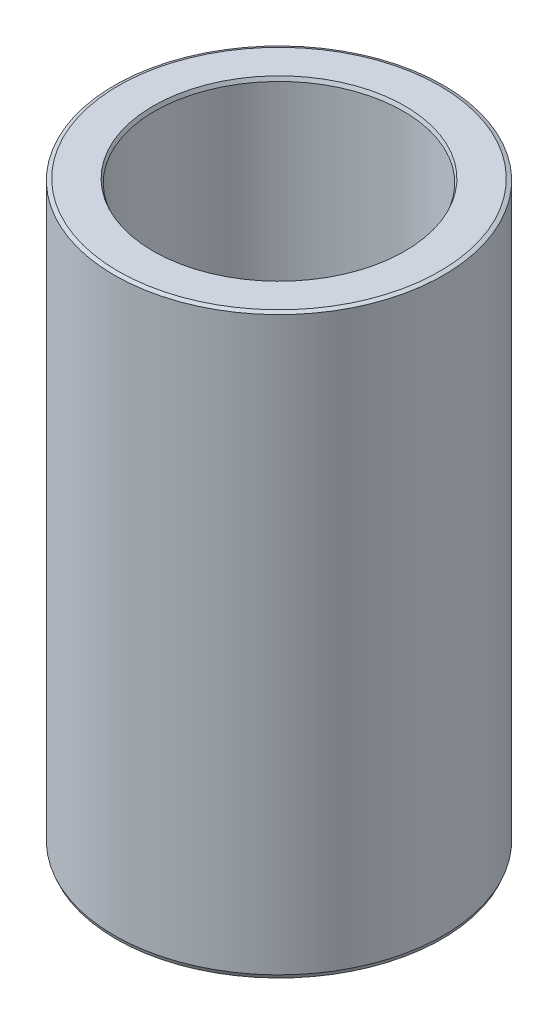
ISO-10303-21;
HEADER;
FILE_DESCRIPTION(('STEP AP214'),'2;1');
FILE_NAME('part.step','',(''),(''),'','','');
FILE_SCHEMA(('AUTOMOTIVE_DESIGN { 1 0 10303 214 1 1 1 1 }'));
ENDSEC;
DATA;
#1=APPLICATION_CONTEXT('core data for automotive mechanical design processes');
#2=APPLICATION_PROTOCOL_DEFINITION('international standard','automotive_design',2000,#1);
#3=PRODUCT_CONTEXT('',#1,'mechanical');
#4=PRODUCT('Part','Part','',(#3));
#5=PRODUCT_RELATED_PRODUCT_CATEGORY('part','',(#4));
#6=PRODUCT_DEFINITION_FORMATION('','',#4);
#7=PRODUCT_DEFINITION_CONTEXT('part definition',#1,'design');
#8=PRODUCT_DEFINITION('design','',#6,#7);
#9=PRODUCT_DEFINITION_SHAPE('','',#8);
#10=(LENGTH_UNIT() NAMED_UNIT(*) SI_UNIT(.MILLI.,.METRE.));
#11=(NAMED_UNIT(*) PLANE_ANGLE_UNIT() SI_UNIT($,.RADIAN.));
#12=(NAMED_UNIT(*) SI_UNIT($,.STERADIAN.) SOLID_ANGLE_UNIT());
#13=UNCERTAINTY_MEASURE_WITH_UNIT(LENGTH_MEASURE(1.E-05),#10,'distance_accuracy_value','');
#14=(GEOMETRIC_REPRESENTATION_CONTEXT(3) GLOBAL_UNCERTAINTY_ASSIGNED_CONTEXT((#13)) GLOBAL_UNIT_ASSIGNED_CONTEXT((#10,
#11,#12)) REPRESENTATION_CONTEXT('',''));
#15=CARTESIAN_POINT('',(0.,0.,0.));
#16=DIRECTION('',(0.,0.,1.));
#17=DIRECTION('',(1.,0.,0.));
#18=AXIS2_PLACEMENT_3D('',#15,#16,#17);
#19=CARTESIAN_POINT('',(0.,105.230688897066,0.));
#20=DIRECTION('',(0.,-1.,0.));
#21=DIRECTION('',(0.,0.,-1.));
#22=AXIS2_PLACEMENT_3D('',#19,#20,#21);
#23=CYLINDRICAL_SURFACE('',#22,30.);
#24=CARTESIAN_POINT('',(0.,0.691459794822546,0.));
#25=DIRECTION('',(0.,1.,0.));
#26=DIRECTION('',(0.,0.,1.));
#27=AXIS2_PLACEMENT_3D('',#24,#25,#26);
#28=CIRCLE('',#27,30.);
#29=CARTESIAN_POINT('',(0.,0.691459794822546,30.));
#30=VERTEX_POINT('',#29);
#31=EDGE_CURVE('E10',#30,#30,#28,.T.);
#32=ORIENTED_EDGE('',*,*,#31,.T.);
#33=EDGE_LOOP('',(#32));
#34=FACE_BOUND('',#33,.T.);
#35=CARTESIAN_POINT('',(0.,104.952152287749,0.));
#36=DIRECTION('',(0.,1.,0.));
#37=DIRECTION('',(0.,0.,1.));
#38=AXIS2_PLACEMENT_3D('',#35,#36,#37);
#39=CIRCLE('',#38,30.);
#40=CARTESIAN_POINT('',(0.,104.952152287749,30.));
#41=VERTEX_POINT('',#40);
#42=EDGE_CURVE('E50',#41,#41,#39,.F.);
#43=ORIENTED_EDGE('',*,*,#42,.T.);
#44=EDGE_LOOP('',(#43));
#45=FACE_BOUND('',#44,.T.);
#46=ADVANCED_FACE('F39',(#34,#45),#23,.T.);
#47=CARTESIAN_POINT('',(0.,105.230688897066,0.));
#48=DIRECTION('',(0.,1.,0.));
#49=DIRECTION('',(0.,0.,1.));
#50=AXIS2_PLACEMENT_3D('',#47,#48,#49);
#51=PLANE('',#50);
#52=CARTESIAN_POINT('',(0.,105.230688897066,0.));
#53=DIRECTION('',(0.,1.,0.));
#54=DIRECTION('',(0.,0.,1.));
#55=AXIS2_PLACEMENT_3D('',#52,#53,#54);
#56=CIRCLE('',#55,22.9440448614805);
#57=CARTESIAN_POINT('',(0.,105.230688897066,22.9440448614805));
#58=VERTEX_POINT('',#57);
#59=EDGE_CURVE('E58',#58,#58,#56,.F.);
#60=ORIENTED_EDGE('',*,*,#59,.T.);
#61=EDGE_LOOP('',(#60));
#62=FACE_BOUND('',#61,.T.);
#63=CARTESIAN_POINT('',(0.,105.230688897066,0.));
#64=DIRECTION('',(0.,1.,0.));
#65=DIRECTION('',(0.,0.,1.));
#66=AXIS2_PLACEMENT_3D('',#63,#64,#65);
#67=CIRCLE('',#66,29.3085402051774);
#68=CARTESIAN_POINT('',(0.,105.230688897066,29.3085402051774));
#69=VERTEX_POINT('',#68);
#70=EDGE_CURVE('E61',#69,#69,#67,.T.);
#71=ORIENTED_EDGE('',*,*,#70,.T.);
#72=EDGE_LOOP('',(#71));
#73=FACE_BOUND('',#72,.T.);
#74=ADVANCED_FACE('F88',(#62,#73),#51,.T.);
#75=CARTESIAN_POINT('',(0.,0.,0.));
#76=DIRECTION('',(0.,1.,0.));
#77=DIRECTION('',(0.,0.,1.));
#78=AXIS2_PLACEMENT_3D('',#75,#76,#77);
#79=PLANE('',#78);
#80=CARTESIAN_POINT('',(0.,0.,0.));
#81=DIRECTION('',(0.,1.,0.));
#82=DIRECTION('',(0.,0.,1.));
#83=AXIS2_PLACEMENT_3D('',#80,#81,#82);
#84=CIRCLE('',#83,23.3569680469868);
#85=CARTESIAN_POINT('',(0.,0.,23.3569680469868));
#86=VERTEX_POINT('',#85);
#87=EDGE_CURVE('E51',#86,#86,#84,.T.);
#88=ORIENTED_EDGE('',*,*,#87,.T.);
#89=EDGE_LOOP('',(#88));
#90=FACE_BOUND('',#89,.T.);
#91=CARTESIAN_POINT('',(0.,0.,0.));
#92=DIRECTION('',(0.,1.,0.));
#93=DIRECTION('',(0.,0.,1.));
#94=AXIS2_PLACEMENT_3D('',#91,#92,#93);
#95=CIRCLE('',#94,29.7214633906837);
#96=CARTESIAN_POINT('',(0.,0.,29.7214633906837));
#97=VERTEX_POINT('',#96);
#98=EDGE_CURVE('E54',#97,#97,#95,.F.);
#99=ORIENTED_EDGE('',*,*,#98,.T.);
#100=EDGE_LOOP('',(#99));
#101=FACE_BOUND('',#100,.T.);
#102=ADVANCED_FACE('F83',(#90,#101),#79,.F.);
#103=CARTESIAN_POINT('',(0.,105.230688897066,0.));
#104=DIRECTION('',(0.,-1.,0.));
#105=DIRECTION('',(0.,0.,-1.));
#106=AXIS2_PLACEMENT_3D('',#103,#104,#105);
#107=CYLINDRICAL_SURFACE('',#106,22.6655082521642);
#108=CARTESIAN_POINT('',(0.,104.539229102243,0.));
#109=DIRECTION('',(0.,1.,0.));
#110=DIRECTION('',(0.,0.,1.));
#111=AXIS2_PLACEMENT_3D('',#108,#109,#110);
#112=CIRCLE('',#111,22.6655082521642);
#113=CARTESIAN_POINT('',(0.,104.539229102243,22.6655082521642));
#114=VERTEX_POINT('',#113);
#115=EDGE_CURVE('E67',#114,#114,#112,.T.);
#116=ORIENTED_EDGE('',*,*,#115,.T.);
#117=EDGE_LOOP('',(#116));
#118=FACE_BOUND('',#117,.T.);
#119=CARTESIAN_POINT('',(0.,0.278536609316385,0.));
#120=DIRECTION('',(0.,1.,0.));
#121=DIRECTION('',(0.,0.,1.));
#122=AXIS2_PLACEMENT_3D('',#119,#120,#121);
#123=CIRCLE('',#122,22.6655082521642);
#124=CARTESIAN_POINT('',(0.,0.278536609316385,22.6655082521642));
#125=VERTEX_POINT('',#124);
#126=EDGE_CURVE('E69',#125,#125,#123,.F.);
#127=ORIENTED_EDGE('',*,*,#126,.T.);
#128=EDGE_LOOP('',(#127));
#129=FACE_BOUND('',#128,.T.);
#130=ADVANCED_FACE('F71',(#118,#129),#107,.F.);
#131=CARTESIAN_POINT('',(0.,104.539229102243,0.));
#132=DIRECTION('',(0.,1.,0.));
#133=DIRECTION('',(0.,0.,1.));
#134=AXIS2_PLACEMENT_3D('',#131,#132,#133);
#135=CONICAL_SURFACE('',#134,22.6655082521642,0.382938497806908);
#136=ORIENTED_EDGE('',*,*,#59,.F.);
#137=EDGE_LOOP('',(#136));
#138=FACE_BOUND('',#137,.T.);
#139=ORIENTED_EDGE('',*,*,#115,.F.);
#140=EDGE_LOOP('',(#139));
#141=FACE_BOUND('',#140,.T.);
#142=ADVANCED_FACE('F77',(#138,#141),#135,.F.);
#143=CARTESIAN_POINT('',(0.,0.,0.));
#144=DIRECTION('',(0.,-1.,0.));
#145=DIRECTION('',(0.,0.,-1.));
#146=AXIS2_PLACEMENT_3D('',#143,#144,#145);
#147=CONICAL_SURFACE('',#146,23.3569680469868,1.18785782898796);
#148=ORIENTED_EDGE('',*,*,#126,.F.);
#149=EDGE_LOOP('',(#148));
#150=FACE_BOUND('',#149,.T.);
#151=ORIENTED_EDGE('',*,*,#87,.F.);
#152=EDGE_LOOP('',(#151));
#153=FACE_BOUND('',#152,.T.);
#154=ADVANCED_FACE('F73',(#150,#153),#147,.F.);
#155=CARTESIAN_POINT('',(0.,0.691459794822546,0.));
#156=DIRECTION('',(0.,1.,0.));
#157=DIRECTION('',(0.,0.,1.));
#158=AXIS2_PLACEMENT_3D('',#155,#156,#157);
#159=CONICAL_SURFACE('',#158,30.,0.38293849780693);
#160=ORIENTED_EDGE('',*,*,#98,.F.);
#161=EDGE_LOOP('',(#160));
#162=FACE_BOUND('',#161,.T.);
#163=ORIENTED_EDGE('',*,*,#31,.F.);
#164=EDGE_LOOP('',(#163));
#165=FACE_BOUND('',#164,.T.);
#166=ADVANCED_FACE('F76',(#162,#165),#159,.T.);
#167=CARTESIAN_POINT('',(0.,105.230688897066,0.));
#168=DIRECTION('',(0.,-1.,0.));
#169=DIRECTION('',(0.,0.,-1.));
#170=AXIS2_PLACEMENT_3D('',#167,#168,#169);
#171=CONICAL_SURFACE('',#170,29.3085402051774,1.18785782898799);
#172=ORIENTED_EDGE('',*,*,#42,.F.);
#173=EDGE_LOOP('',(#172));
#174=FACE_BOUND('',#173,.T.);
#175=ORIENTED_EDGE('',*,*,#70,.F.);
#176=EDGE_LOOP('',(#175));
#177=FACE_BOUND('',#176,.T.);
#178=ADVANCED_FACE('F45',(#174,#177),#171,.T.);
#179=CLOSED_SHELL('',(#46,#74,#102,#130,#142,#154,#166,#178));
#180=MANIFOLD_SOLID_BREP('B2',#179);
#181=ADVANCED_BREP_SHAPE_REPRESENTATION('',(#18,#180),#14);
#182=SHAPE_DEFINITION_REPRESENTATION(#9,#181);
ENDSEC;
END-ISO-10303-21;
